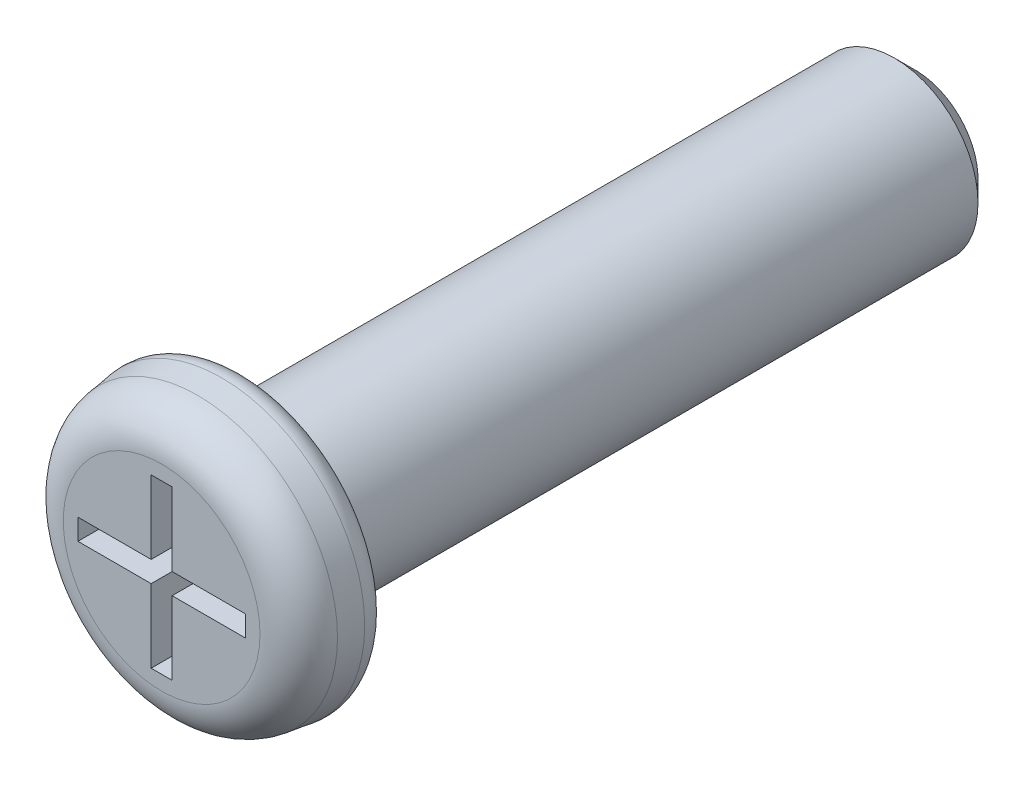
ISO-10303-21;
HEADER;
FILE_DESCRIPTION(('STEP AP214'),'2;1');
FILE_NAME('part.step','',(''),(''),'','','');
FILE_SCHEMA(('AUTOMOTIVE_DESIGN { 1 0 10303 214 1 1 1 1 }'));
ENDSEC;
DATA;
#1=APPLICATION_CONTEXT('core data for automotive mechanical design processes');
#2=APPLICATION_PROTOCOL_DEFINITION('international standard','automotive_design',2000,#1);
#3=PRODUCT_CONTEXT('',#1,'mechanical');
#4=PRODUCT('Part','Part','',(#3));
#5=PRODUCT_RELATED_PRODUCT_CATEGORY('part','',(#4));
#6=PRODUCT_DEFINITION_FORMATION('','',#4);
#7=PRODUCT_DEFINITION_CONTEXT('part definition',#1,'design');
#8=PRODUCT_DEFINITION('design','',#6,#7);
#9=PRODUCT_DEFINITION_SHAPE('','',#8);
#10=(LENGTH_UNIT() NAMED_UNIT(*) SI_UNIT(.MILLI.,.METRE.));
#11=(NAMED_UNIT(*) PLANE_ANGLE_UNIT() SI_UNIT($,.RADIAN.));
#12=(NAMED_UNIT(*) SI_UNIT($,.STERADIAN.) SOLID_ANGLE_UNIT());
#13=UNCERTAINTY_MEASURE_WITH_UNIT(LENGTH_MEASURE(1.E-05),#10,'distance_accuracy_value','');
#14=(GEOMETRIC_REPRESENTATION_CONTEXT(3) GLOBAL_UNCERTAINTY_ASSIGNED_CONTEXT((#13)) GLOBAL_UNIT_ASSIGNED_CONTEXT((#10,
#11,#12)) REPRESENTATION_CONTEXT('',''));
#15=CARTESIAN_POINT('',(0.,0.,0.));
#16=DIRECTION('',(0.,0.,1.));
#17=DIRECTION('',(1.,0.,0.));
#18=AXIS2_PLACEMENT_3D('',#15,#16,#17);
#19=CARTESIAN_POINT('',(0.,0.,0.));
#20=DIRECTION('',(0.,0.,1.));
#21=DIRECTION('',(1.,0.,0.));
#22=AXIS2_PLACEMENT_3D('',#19,#20,#21);
#23=PLANE('',#22);
#24=CARTESIAN_POINT('',(0.,0.,0.));
#25=DIRECTION('',(0.,0.,1.));
#26=DIRECTION('',(1.,0.,0.));
#27=AXIS2_PLACEMENT_3D('',#24,#25,#26);
#28=CIRCLE('',#27,1.46240789819475);
#29=CARTESIAN_POINT('',(1.46240789819475,0.,0.));
#30=VERTEX_POINT('',#29);
#31=EDGE_CURVE('E11',#30,#30,#28,.F.);
#32=ORIENTED_EDGE('',*,*,#31,.T.);
#33=EDGE_LOOP('',(#32));
#34=FACE_BOUND('',#33,.T.);
#35=CARTESIAN_POINT('',(0.,0.,0.));
#36=DIRECTION('',(0.,0.,1.));
#37=DIRECTION('',(1.,0.,0.));
#38=AXIS2_PLACEMENT_3D('',#35,#36,#37);
#39=CIRCLE('',#38,1.);
#40=CARTESIAN_POINT('',(1.,0.,0.));
#41=VERTEX_POINT('',#40);
#42=EDGE_CURVE('E230',#41,#41,#39,.F.);
#43=ORIENTED_EDGE('',*,*,#42,.F.);
#44=EDGE_LOOP('',(#43));
#45=FACE_BOUND('',#44,.T.);
#46=ADVANCED_FACE('F31',(#34,#45),#23,.F.);
#47=CARTESIAN_POINT('',(0.,0.,0.));
#48=DIRECTION('',(0.,0.,-1.));
#49=DIRECTION('',(1.,0.,0.));
#50=AXIS2_PLACEMENT_3D('',#47,#48,#49);
#51=CONICAL_SURFACE('',#50,1.75,0.139626340159547);
#52=CARTESIAN_POINT('',(0.,0.,0.284793275240017));
#53=DIRECTION('',(0.,0.,1.));
#54=DIRECTION('',(1.,0.,0.));
#55=AXIS2_PLACEMENT_3D('',#52,#53,#54);
#56=CIRCLE('',#55,1.70997491538014);
#57=CARTESIAN_POINT('',(1.70997491538014,0.,0.284793275240017));
#58=VERTEX_POINT('',#57);
#59=EDGE_CURVE('E39',#58,#58,#56,.T.);
#60=ORIENTED_EDGE('',*,*,#59,.T.);
#61=EDGE_LOOP('',(#60));
#62=FACE_BOUND('',#61,.T.);
#63=CARTESIAN_POINT('',(0.,0.,0.569586550480033));
#64=DIRECTION('',(0.,0.,-1.));
#65=DIRECTION('',(-1.,0.,0.));
#66=AXIS2_PLACEMENT_3D('',#63,#64,#65);
#67=CIRCLE('',#66,1.66994983076028);
#68=CARTESIAN_POINT('',(-1.66994983076028,0.,0.569586550480033));
#69=VERTEX_POINT('',#68);
#70=EDGE_CURVE('E227',#69,#69,#67,.T.);
#71=ORIENTED_EDGE('',*,*,#70,.T.);
#72=EDGE_LOOP('',(#71));
#73=FACE_BOUND('',#72,.T.);
#74=ADVANCED_FACE('F33',(#62,#73),#51,.T.);
#75=CARTESIAN_POINT('',(0.,0.,1.));
#76=DIRECTION('',(0.,0.,1.));
#77=DIRECTION('',(1.,0.,0.));
#78=AXIS2_PLACEMENT_3D('',#75,#76,#77);
#79=PLANE('',#78);
#80=DIRECTION('',(-1.,0.,0.));
#81=VECTOR('',#80,1.);
#82=CARTESIAN_POINT('',(0.125,1.,1.));
#83=LINE('',#82,#81);
#84=CARTESIAN_POINT('',(0.125,1.,1.));
#85=VERTEX_POINT('',#84);
#86=CARTESIAN_POINT('',(-0.125,1.,1.));
#87=VERTEX_POINT('',#86);
#88=EDGE_CURVE('E46',#85,#87,#83,.T.);
#89=ORIENTED_EDGE('',*,*,#88,.F.);
#90=DIRECTION('',(0.,1.,0.));
#91=VECTOR('',#90,1.);
#92=CARTESIAN_POINT('',(0.125,1.,1.));
#93=LINE('',#92,#91);
#94=CARTESIAN_POINT('',(0.125,0.124999999999999,1.));
#95=VERTEX_POINT('',#94);
#96=EDGE_CURVE('E170',#95,#85,#93,.T.);
#97=ORIENTED_EDGE('',*,*,#96,.F.);
#98=DIRECTION('',(-1.,0.,0.));
#99=VECTOR('',#98,1.);
#100=CARTESIAN_POINT('',(1.,0.124999999999996,1.));
#101=LINE('',#100,#99);
#102=CARTESIAN_POINT('',(1.,0.124999999999996,1.));
#103=VERTEX_POINT('',#102);
#104=EDGE_CURVE('E167',#103,#95,#101,.T.);
#105=ORIENTED_EDGE('',*,*,#104,.F.);
#106=DIRECTION('',(0.,1.,0.));
#107=VECTOR('',#106,1.);
#108=CARTESIAN_POINT('',(1.,-0.125000000000003,1.));
#109=LINE('',#108,#107);
#110=CARTESIAN_POINT('',(1.,-0.125000000000003,1.));
#111=VERTEX_POINT('',#110);
#112=EDGE_CURVE('E164',#111,#103,#109,.T.);
#113=ORIENTED_EDGE('',*,*,#112,.F.);
#114=DIRECTION('',(1.,0.,0.));
#115=VECTOR('',#114,1.);
#116=CARTESIAN_POINT('',(1.,-0.125000000000003,1.));
#117=LINE('',#116,#115);
#118=CARTESIAN_POINT('',(0.124999999999999,-0.125,1.));
#119=VERTEX_POINT('',#118);
#120=EDGE_CURVE('E161',#119,#111,#117,.T.);
#121=ORIENTED_EDGE('',*,*,#120,.F.);
#122=DIRECTION('',(0.,1.,0.));
#123=VECTOR('',#122,1.);
#124=CARTESIAN_POINT('',(0.124999999999993,-1.,1.));
#125=LINE('',#124,#123);
#126=CARTESIAN_POINT('',(0.124999999999993,-1.,1.));
#127=VERTEX_POINT('',#126);
#128=EDGE_CURVE('E158',#127,#119,#125,.T.);
#129=ORIENTED_EDGE('',*,*,#128,.F.);
#130=DIRECTION('',(1.,0.,0.));
#131=VECTOR('',#130,1.);
#132=CARTESIAN_POINT('',(-0.125000000000007,-0.999999999999999,1.));
#133=LINE('',#132,#131);
#134=CARTESIAN_POINT('',(-0.125000000000007,-0.999999999999999,1.));
#135=VERTEX_POINT('',#134);
#136=EDGE_CURVE('E155',#135,#127,#133,.T.);
#137=ORIENTED_EDGE('',*,*,#136,.F.);
#138=DIRECTION('',(0.,-1.,0.));
#139=VECTOR('',#138,1.);
#140=CARTESIAN_POINT('',(-0.125000000000007,-0.999999999999999,1.));
#141=LINE('',#140,#139);
#142=CARTESIAN_POINT('',(-0.125000000000001,-0.124999999999998,1.));
#143=VERTEX_POINT('',#142);
#144=EDGE_CURVE('E152',#143,#135,#141,.T.);
#145=ORIENTED_EDGE('',*,*,#144,.F.);
#146=DIRECTION('',(1.,0.,0.));
#147=VECTOR('',#146,1.);
#148=CARTESIAN_POINT('',(-1.,-0.124999999999989,1.));
#149=LINE('',#148,#147);
#150=CARTESIAN_POINT('',(-1.,-0.124999999999989,1.));
#151=VERTEX_POINT('',#150);
#152=EDGE_CURVE('E146',#151,#143,#149,.T.);
#153=ORIENTED_EDGE('',*,*,#152,.F.);
#154=DIRECTION('',(0.,-1.,0.));
#155=VECTOR('',#154,1.);
#156=CARTESIAN_POINT('',(-0.999999999999999,0.12500000000001,1.));
#157=LINE('',#156,#155);
#158=CARTESIAN_POINT('',(-0.999999999999999,0.12500000000001,1.));
#159=VERTEX_POINT('',#158);
#160=EDGE_CURVE('E144',#159,#151,#157,.T.);
#161=ORIENTED_EDGE('',*,*,#160,.F.);
#162=DIRECTION('',(-1.,0.,0.));
#163=VECTOR('',#162,1.);
#164=CARTESIAN_POINT('',(-0.999999999999999,0.12500000000001,1.));
#165=LINE('',#164,#163);
#166=CARTESIAN_POINT('',(-0.125,0.125000000000001,1.));
#167=VERTEX_POINT('',#166);
#168=EDGE_CURVE('E125',#167,#159,#165,.T.);
#169=ORIENTED_EDGE('',*,*,#168,.F.);
#170=DIRECTION('',(0.,-1.,0.));
#171=VECTOR('',#170,1.);
#172=CARTESIAN_POINT('',(-0.125,1.,1.));
#173=LINE('',#172,#171);
#174=EDGE_CURVE('E136',#87,#167,#173,.T.);
#175=ORIENTED_EDGE('',*,*,#174,.F.);
#176=EDGE_LOOP('',(#89,#97,#105,#113,#121,#129,#137,#145,#153,#161,#169,#175));
#177=FACE_BOUND('',#176,.T.);
#178=CARTESIAN_POINT('',(0.,0.,1.));
#179=DIRECTION('',(0.,0.,1.));
#180=DIRECTION('',(1.,0.,0.));
#181=AXIS2_PLACEMENT_3D('',#178,#179,#180);
#182=CIRCLE('',#181,1.1748157963895);
#183=CARTESIAN_POINT('',(1.1748157963895,0.,1.));
#184=VERTEX_POINT('',#183);
#185=EDGE_CURVE('E206',#184,#184,#182,.T.);
#186=ORIENTED_EDGE('',*,*,#185,.T.);
#187=EDGE_LOOP('',(#186));
#188=FACE_BOUND('',#187,.T.);
#189=ADVANCED_FACE('F140',(#177,#188),#79,.T.);
#190=CARTESIAN_POINT('',(0.,0.,0.5));
#191=DIRECTION('',(0.,0.,1.));
#192=DIRECTION('',(1.,0.,0.));
#193=AXIS2_PLACEMENT_3D('',#190,#191,#192);
#194=TOROIDAL_SURFACE('',#193,1.1748157963895,0.5);
#195=ORIENTED_EDGE('',*,*,#70,.F.);
#196=EDGE_LOOP('',(#195));
#197=FACE_BOUND('',#196,.T.);
#198=ORIENTED_EDGE('',*,*,#185,.F.);
#199=EDGE_LOOP('',(#198));
#200=FACE_BOUND('',#199,.T.);
#201=ADVANCED_FACE('F262',(#197,#200),#194,.T.);
#202=CARTESIAN_POINT('',(0.,0.,-8.));
#203=DIRECTION('',(0.,0.,1.));
#204=DIRECTION('',(1.,0.,0.));
#205=AXIS2_PLACEMENT_3D('',#202,#203,#204);
#206=CYLINDRICAL_SURFACE('',#205,1.);
#207=CARTESIAN_POINT('',(0.,0.,-7.75));
#208=DIRECTION('',(0.,0.,-1.));
#209=DIRECTION('',(-1.,0.,0.));
#210=AXIS2_PLACEMENT_3D('',#207,#208,#209);
#211=CIRCLE('',#210,1.);
#212=CARTESIAN_POINT('',(-1.,0.,-7.75));
#213=VERTEX_POINT('',#212);
#214=EDGE_CURVE('E236',#213,#213,#211,.F.);
#215=ORIENTED_EDGE('',*,*,#214,.T.);
#216=EDGE_LOOP('',(#215));
#217=FACE_BOUND('',#216,.T.);
#218=ORIENTED_EDGE('',*,*,#42,.T.);
#219=EDGE_LOOP('',(#218));
#220=FACE_BOUND('',#219,.T.);
#221=ADVANCED_FACE('F268',(#217,#220),#206,.T.);
#222=CARTESIAN_POINT('',(0.,0.,-8.));
#223=DIRECTION('',(0.,0.,-1.));
#224=DIRECTION('',(-1.,0.,0.));
#225=AXIS2_PLACEMENT_3D('',#222,#223,#224);
#226=PLANE('',#225);
#227=CARTESIAN_POINT('',(0.,0.,-8.));
#228=DIRECTION('',(0.,0.,-1.));
#229=DIRECTION('',(-1.,0.,0.));
#230=AXIS2_PLACEMENT_3D('',#227,#228,#229);
#231=CIRCLE('',#230,0.749999999999996);
#232=CARTESIAN_POINT('',(-0.749999999999996,0.,-8.));
#233=VERTEX_POINT('',#232);
#234=EDGE_CURVE('E233',#233,#233,#231,.T.);
#235=ORIENTED_EDGE('',*,*,#234,.T.);
#236=EDGE_LOOP('',(#235));
#237=FACE_BOUND('',#236,.T.);
#238=ADVANCED_FACE('F273',(#237),#226,.T.);
#239=CARTESIAN_POINT('',(0.,0.,-8.));
#240=DIRECTION('',(0.,0.,1.));
#241=DIRECTION('',(1.,0.,0.));
#242=AXIS2_PLACEMENT_3D('',#239,#240,#241);
#243=CONICAL_SURFACE('',#242,0.749999999999996,0.785398163397453);
#244=ORIENTED_EDGE('',*,*,#214,.F.);
#245=EDGE_LOOP('',(#244));
#246=FACE_BOUND('',#245,.T.);
#247=ORIENTED_EDGE('',*,*,#234,.F.);
#248=EDGE_LOOP('',(#247));
#249=FACE_BOUND('',#248,.T.);
#250=ADVANCED_FACE('F281',(#246,#249),#243,.T.);
#251=CARTESIAN_POINT('',(0.125,1.,0.5));
#252=DIRECTION('',(0.,1.,0.));
#253=DIRECTION('',(0.,0.,1.));
#254=AXIS2_PLACEMENT_3D('',#251,#252,#253);
#255=PLANE('',#254);
#256=ORIENTED_EDGE('',*,*,#88,.T.);
#257=DIRECTION('',(0.,0.,1.));
#258=VECTOR('',#257,1.);
#259=CARTESIAN_POINT('',(-0.125,1.,0.5));
#260=LINE('',#259,#258);
#261=CARTESIAN_POINT('',(-0.125,1.,0.5));
#262=VERTEX_POINT('',#261);
#263=EDGE_CURVE('E133',#262,#87,#260,.T.);
#264=ORIENTED_EDGE('',*,*,#263,.F.);
#265=DIRECTION('',(-1.,0.,0.));
#266=VECTOR('',#265,1.);
#267=CARTESIAN_POINT('',(0.125,1.,0.5));
#268=LINE('',#267,#266);
#269=CARTESIAN_POINT('',(0.125,1.,0.5));
#270=VERTEX_POINT('',#269);
#271=EDGE_CURVE('E172',#270,#262,#268,.T.);
#272=ORIENTED_EDGE('',*,*,#271,.F.);
#273=DIRECTION('',(0.,0.,1.));
#274=VECTOR('',#273,1.);
#275=CARTESIAN_POINT('',(0.125,1.,0.5));
#276=LINE('',#275,#274);
#277=EDGE_CURVE('E53',#270,#85,#276,.T.);
#278=ORIENTED_EDGE('',*,*,#277,.T.);
#279=EDGE_LOOP('',(#256,#264,#272,#278));
#280=FACE_BOUND('',#279,.T.);
#281=ADVANCED_FACE('F288',(#280),#255,.F.);
#282=CARTESIAN_POINT('',(0.125,1.,0.5));
#283=DIRECTION('',(1.,0.,0.));
#284=DIRECTION('',(0.,1.,0.));
#285=AXIS2_PLACEMENT_3D('',#282,#283,#284);
#286=PLANE('',#285);
#287=ORIENTED_EDGE('',*,*,#96,.T.);
#288=ORIENTED_EDGE('',*,*,#277,.F.);
#289=DIRECTION('',(0.,1.,0.));
#290=VECTOR('',#289,1.);
#291=CARTESIAN_POINT('',(0.125,1.,0.5));
#292=LINE('',#291,#290);
#293=CARTESIAN_POINT('',(0.125,0.124999999999999,0.5));
#294=VERTEX_POINT('',#293);
#295=EDGE_CURVE('E202',#294,#270,#292,.T.);
#296=ORIENTED_EDGE('',*,*,#295,.F.);
#297=DIRECTION('',(0.,0.,1.));
#298=VECTOR('',#297,1.);
#299=CARTESIAN_POINT('',(0.125,0.124999999999999,0.5));
#300=LINE('',#299,#298);
#301=EDGE_CURVE('E207',#294,#95,#300,.T.);
#302=ORIENTED_EDGE('',*,*,#301,.T.);
#303=EDGE_LOOP('',(#287,#288,#296,#302));
#304=FACE_BOUND('',#303,.T.);
#305=ADVANCED_FACE('F292',(#304),#286,.F.);
#306=CARTESIAN_POINT('',(1.,0.124999999999996,0.5));
#307=DIRECTION('',(0.,1.,0.));
#308=DIRECTION('',(-1.,0.,0.));
#309=AXIS2_PLACEMENT_3D('',#306,#307,#308);
#310=PLANE('',#309);
#311=ORIENTED_EDGE('',*,*,#104,.T.);
#312=ORIENTED_EDGE('',*,*,#301,.F.);
#313=DIRECTION('',(-1.,0.,0.));
#314=VECTOR('',#313,1.);
#315=CARTESIAN_POINT('',(1.,0.124999999999996,0.5));
#316=LINE('',#315,#314);
#317=CARTESIAN_POINT('',(1.,0.124999999999996,0.5));
#318=VERTEX_POINT('',#317);
#319=EDGE_CURVE('E199',#318,#294,#316,.T.);
#320=ORIENTED_EDGE('',*,*,#319,.F.);
#321=DIRECTION('',(0.,0.,1.));
#322=VECTOR('',#321,1.);
#323=CARTESIAN_POINT('',(1.,0.124999999999996,0.5));
#324=LINE('',#323,#322);
#325=EDGE_CURVE('E209',#318,#103,#324,.T.);
#326=ORIENTED_EDGE('',*,*,#325,.T.);
#327=EDGE_LOOP('',(#311,#312,#320,#326));
#328=FACE_BOUND('',#327,.T.);
#329=ADVANCED_FACE('F324',(#328),#310,.F.);
#330=CARTESIAN_POINT('',(1.,-0.125000000000003,0.5));
#331=DIRECTION('',(1.,0.,0.));
#332=DIRECTION('',(0.,1.,0.));
#333=AXIS2_PLACEMENT_3D('',#330,#331,#332);
#334=PLANE('',#333);
#335=ORIENTED_EDGE('',*,*,#112,.T.);
#336=ORIENTED_EDGE('',*,*,#325,.F.);
#337=DIRECTION('',(0.,1.,0.));
#338=VECTOR('',#337,1.);
#339=CARTESIAN_POINT('',(1.,-0.125000000000003,0.5));
#340=LINE('',#339,#338);
#341=CARTESIAN_POINT('',(1.,-0.125000000000003,0.5));
#342=VERTEX_POINT('',#341);
#343=EDGE_CURVE('E196',#342,#318,#340,.T.);
#344=ORIENTED_EDGE('',*,*,#343,.F.);
#345=DIRECTION('',(0.,0.,1.));
#346=VECTOR('',#345,1.);
#347=CARTESIAN_POINT('',(1.,-0.125000000000003,0.5));
#348=LINE('',#347,#346);
#349=EDGE_CURVE('E211',#342,#111,#348,.T.);
#350=ORIENTED_EDGE('',*,*,#349,.T.);
#351=EDGE_LOOP('',(#335,#336,#344,#350));
#352=FACE_BOUND('',#351,.T.);
#353=ADVANCED_FACE('F320',(#352),#334,.F.);
#354=CARTESIAN_POINT('',(1.,-0.125000000000003,0.5));
#355=DIRECTION('',(0.,-1.,0.));
#356=DIRECTION('',(1.,0.,0.));
#357=AXIS2_PLACEMENT_3D('',#354,#355,#356);
#358=PLANE('',#357);
#359=ORIENTED_EDGE('',*,*,#120,.T.);
#360=ORIENTED_EDGE('',*,*,#349,.F.);
#361=DIRECTION('',(1.,0.,0.));
#362=VECTOR('',#361,1.);
#363=CARTESIAN_POINT('',(1.,-0.125000000000003,0.5));
#364=LINE('',#363,#362);
#365=CARTESIAN_POINT('',(0.124999999999999,-0.125,0.5));
#366=VERTEX_POINT('',#365);
#367=EDGE_CURVE('E193',#366,#342,#364,.T.);
#368=ORIENTED_EDGE('',*,*,#367,.F.);
#369=DIRECTION('',(0.,0.,1.));
#370=VECTOR('',#369,1.);
#371=CARTESIAN_POINT('',(0.124999999999999,-0.125,0.5));
#372=LINE('',#371,#370);
#373=EDGE_CURVE('E213',#366,#119,#372,.T.);
#374=ORIENTED_EDGE('',*,*,#373,.T.);
#375=EDGE_LOOP('',(#359,#360,#368,#374));
#376=FACE_BOUND('',#375,.T.);
#377=ADVANCED_FACE('F316',(#376),#358,.F.);
#378=CARTESIAN_POINT('',(0.124999999999993,-1.,0.5));
#379=DIRECTION('',(1.,0.,0.));
#380=DIRECTION('',(0.,1.,0.));
#381=AXIS2_PLACEMENT_3D('',#378,#379,#380);
#382=PLANE('',#381);
#383=ORIENTED_EDGE('',*,*,#128,.T.);
#384=ORIENTED_EDGE('',*,*,#373,.F.);
#385=DIRECTION('',(0.,1.,0.));
#386=VECTOR('',#385,1.);
#387=CARTESIAN_POINT('',(0.124999999999993,-1.,0.5));
#388=LINE('',#387,#386);
#389=CARTESIAN_POINT('',(0.124999999999993,-1.,0.5));
#390=VERTEX_POINT('',#389);
#391=EDGE_CURVE('E190',#390,#366,#388,.T.);
#392=ORIENTED_EDGE('',*,*,#391,.F.);
#393=DIRECTION('',(0.,0.,1.));
#394=VECTOR('',#393,1.);
#395=CARTESIAN_POINT('',(0.124999999999993,-1.,0.5));
#396=LINE('',#395,#394);
#397=EDGE_CURVE('E215',#390,#127,#396,.T.);
#398=ORIENTED_EDGE('',*,*,#397,.T.);
#399=EDGE_LOOP('',(#383,#384,#392,#398));
#400=FACE_BOUND('',#399,.T.);
#401=ADVANCED_FACE('F312',(#400),#382,.F.);
#402=CARTESIAN_POINT('',(-0.125000000000007,-0.999999999999999,0.5));
#403=DIRECTION('',(0.,-1.,0.));
#404=DIRECTION('',(1.,0.,0.));
#405=AXIS2_PLACEMENT_3D('',#402,#403,#404);
#406=PLANE('',#405);
#407=ORIENTED_EDGE('',*,*,#136,.T.);
#408=ORIENTED_EDGE('',*,*,#397,.F.);
#409=DIRECTION('',(1.,0.,0.));
#410=VECTOR('',#409,1.);
#411=CARTESIAN_POINT('',(-0.125000000000007,-0.999999999999999,0.5));
#412=LINE('',#411,#410);
#413=CARTESIAN_POINT('',(-0.125000000000007,-0.999999999999999,0.5));
#414=VERTEX_POINT('',#413);
#415=EDGE_CURVE('E187',#414,#390,#412,.T.);
#416=ORIENTED_EDGE('',*,*,#415,.F.);
#417=DIRECTION('',(0.,0.,1.));
#418=VECTOR('',#417,1.);
#419=CARTESIAN_POINT('',(-0.125000000000007,-0.999999999999999,0.5));
#420=LINE('',#419,#418);
#421=EDGE_CURVE('E217',#414,#135,#420,.T.);
#422=ORIENTED_EDGE('',*,*,#421,.T.);
#423=EDGE_LOOP('',(#407,#408,#416,#422));
#424=FACE_BOUND('',#423,.T.);
#425=ADVANCED_FACE('F308',(#424),#406,.F.);
#426=CARTESIAN_POINT('',(-0.125000000000007,-0.999999999999999,0.5));
#427=DIRECTION('',(-1.,0.,0.));
#428=DIRECTION('',(0.,-1.,0.));
#429=AXIS2_PLACEMENT_3D('',#426,#427,#428);
#430=PLANE('',#429);
#431=ORIENTED_EDGE('',*,*,#144,.T.);
#432=ORIENTED_EDGE('',*,*,#421,.F.);
#433=DIRECTION('',(0.,-1.,0.));
#434=VECTOR('',#433,1.);
#435=CARTESIAN_POINT('',(-0.125000000000007,-0.999999999999999,0.5));
#436=LINE('',#435,#434);
#437=CARTESIAN_POINT('',(-0.125000000000001,-0.124999999999998,0.5));
#438=VERTEX_POINT('',#437);
#439=EDGE_CURVE('E184',#438,#414,#436,.T.);
#440=ORIENTED_EDGE('',*,*,#439,.F.);
#441=DIRECTION('',(0.,0.,1.));
#442=VECTOR('',#441,1.);
#443=CARTESIAN_POINT('',(-0.125000000000001,-0.124999999999998,0.5));
#444=LINE('',#443,#442);
#445=EDGE_CURVE('E219',#438,#143,#444,.T.);
#446=ORIENTED_EDGE('',*,*,#445,.T.);
#447=EDGE_LOOP('',(#431,#432,#440,#446));
#448=FACE_BOUND('',#447,.T.);
#449=ADVANCED_FACE('F304',(#448),#430,.F.);
#450=CARTESIAN_POINT('',(-1.,-0.124999999999989,0.5));
#451=DIRECTION('',(0.,-1.,0.));
#452=DIRECTION('',(1.,0.,0.));
#453=AXIS2_PLACEMENT_3D('',#450,#451,#452);
#454=PLANE('',#453);
#455=ORIENTED_EDGE('',*,*,#152,.T.);
#456=ORIENTED_EDGE('',*,*,#445,.F.);
#457=DIRECTION('',(1.,0.,0.));
#458=VECTOR('',#457,1.);
#459=CARTESIAN_POINT('',(-1.,-0.124999999999989,0.5));
#460=LINE('',#459,#458);
#461=CARTESIAN_POINT('',(-1.,-0.124999999999989,0.5));
#462=VERTEX_POINT('',#461);
#463=EDGE_CURVE('E181',#462,#438,#460,.T.);
#464=ORIENTED_EDGE('',*,*,#463,.F.);
#465=DIRECTION('',(0.,0.,1.));
#466=VECTOR('',#465,1.);
#467=CARTESIAN_POINT('',(-1.,-0.124999999999989,0.5));
#468=LINE('',#467,#466);
#469=EDGE_CURVE('E221',#462,#151,#468,.T.);
#470=ORIENTED_EDGE('',*,*,#469,.T.);
#471=EDGE_LOOP('',(#455,#456,#464,#470));
#472=FACE_BOUND('',#471,.T.);
#473=ADVANCED_FACE('F300',(#472),#454,.F.);
#474=CARTESIAN_POINT('',(-0.999999999999999,0.12500000000001,0.5));
#475=DIRECTION('',(-1.,0.,0.));
#476=DIRECTION('',(0.,-1.,0.));
#477=AXIS2_PLACEMENT_3D('',#474,#475,#476);
#478=PLANE('',#477);
#479=ORIENTED_EDGE('',*,*,#160,.T.);
#480=ORIENTED_EDGE('',*,*,#469,.F.);
#481=DIRECTION('',(0.,-1.,0.));
#482=VECTOR('',#481,1.);
#483=CARTESIAN_POINT('',(-0.999999999999999,0.12500000000001,0.5));
#484=LINE('',#483,#482);
#485=CARTESIAN_POINT('',(-0.999999999999999,0.12500000000001,0.5));
#486=VERTEX_POINT('',#485);
#487=EDGE_CURVE('E178',#486,#462,#484,.T.);
#488=ORIENTED_EDGE('',*,*,#487,.F.);
#489=DIRECTION('',(0.,0.,1.));
#490=VECTOR('',#489,1.);
#491=CARTESIAN_POINT('',(-0.999999999999999,0.12500000000001,0.5));
#492=LINE('',#491,#490);
#493=EDGE_CURVE('E132',#486,#159,#492,.T.);
#494=ORIENTED_EDGE('',*,*,#493,.T.);
#495=EDGE_LOOP('',(#479,#480,#488,#494));
#496=FACE_BOUND('',#495,.T.);
#497=ADVANCED_FACE('F297',(#496),#478,.F.);
#498=CARTESIAN_POINT('',(-0.999999999999999,0.12500000000001,0.5));
#499=DIRECTION('',(0.,1.,0.));
#500=DIRECTION('',(-1.,0.,0.));
#501=AXIS2_PLACEMENT_3D('',#498,#499,#500);
#502=PLANE('',#501);
#503=ORIENTED_EDGE('',*,*,#168,.T.);
#504=ORIENTED_EDGE('',*,*,#493,.F.);
#505=DIRECTION('',(-1.,0.,0.));
#506=VECTOR('',#505,1.);
#507=CARTESIAN_POINT('',(-0.999999999999999,0.12500000000001,0.5));
#508=LINE('',#507,#506);
#509=CARTESIAN_POINT('',(-0.125,0.125000000000001,0.5));
#510=VERTEX_POINT('',#509);
#511=EDGE_CURVE('E128',#510,#486,#508,.T.);
#512=ORIENTED_EDGE('',*,*,#511,.F.);
#513=DIRECTION('',(0.,0.,1.));
#514=VECTOR('',#513,1.);
#515=CARTESIAN_POINT('',(-0.125,0.125000000000001,0.5));
#516=LINE('',#515,#514);
#517=EDGE_CURVE('E121',#510,#167,#516,.T.);
#518=ORIENTED_EDGE('',*,*,#517,.T.);
#519=EDGE_LOOP('',(#503,#504,#512,#518));
#520=FACE_BOUND('',#519,.T.);
#521=ADVANCED_FACE('F123',(#520),#502,.F.);
#522=CARTESIAN_POINT('',(-0.125,1.,0.5));
#523=DIRECTION('',(-1.,0.,0.));
#524=DIRECTION('',(0.,-1.,0.));
#525=AXIS2_PLACEMENT_3D('',#522,#523,#524);
#526=PLANE('',#525);
#527=ORIENTED_EDGE('',*,*,#174,.T.);
#528=ORIENTED_EDGE('',*,*,#517,.F.);
#529=DIRECTION('',(0.,-1.,0.));
#530=VECTOR('',#529,1.);
#531=CARTESIAN_POINT('',(-0.125,1.,0.5));
#532=LINE('',#531,#530);
#533=EDGE_CURVE('E175',#262,#510,#532,.T.);
#534=ORIENTED_EDGE('',*,*,#533,.F.);
#535=ORIENTED_EDGE('',*,*,#263,.T.);
#536=EDGE_LOOP('',(#527,#528,#534,#535));
#537=FACE_BOUND('',#536,.T.);
#538=ADVANCED_FACE('F137',(#537),#526,.F.);
#539=CARTESIAN_POINT('',(0.125,1.,0.5));
#540=DIRECTION('',(0.,0.,1.));
#541=DIRECTION('',(1.,0.,0.));
#542=AXIS2_PLACEMENT_3D('',#539,#540,#541);
#543=PLANE('',#542);
#544=ORIENTED_EDGE('',*,*,#271,.T.);
#545=ORIENTED_EDGE('',*,*,#533,.T.);
#546=ORIENTED_EDGE('',*,*,#511,.T.);
#547=ORIENTED_EDGE('',*,*,#487,.T.);
#548=ORIENTED_EDGE('',*,*,#463,.T.);
#549=ORIENTED_EDGE('',*,*,#439,.T.);
#550=ORIENTED_EDGE('',*,*,#415,.T.);
#551=ORIENTED_EDGE('',*,*,#391,.T.);
#552=ORIENTED_EDGE('',*,*,#367,.T.);
#553=ORIENTED_EDGE('',*,*,#343,.T.);
#554=ORIENTED_EDGE('',*,*,#319,.T.);
#555=ORIENTED_EDGE('',*,*,#295,.T.);
#556=EDGE_LOOP('',(#544,#545,#546,#547,#548,#549,#550,#551,#552,#553,#554,#555));
#557=FACE_BOUND('',#556,.T.);
#558=ADVANCED_FACE('F245',(#557),#543,.T.);
#559=CARTESIAN_POINT('',(0.,0.,0.25));
#560=DIRECTION('',(0.,0.,1.));
#561=DIRECTION('',(1.,0.,0.));
#562=AXIS2_PLACEMENT_3D('',#559,#560,#561);
#563=TOROIDAL_SURFACE('',#562,1.46240789819475,0.25);
#564=ORIENTED_EDGE('',*,*,#31,.F.);
#565=EDGE_LOOP('',(#564));
#566=FACE_BOUND('',#565,.T.);
#567=ORIENTED_EDGE('',*,*,#59,.F.);
#568=EDGE_LOOP('',(#567));
#569=FACE_BOUND('',#568,.T.);
#570=ADVANCED_FACE('F243',(#566,#569),#563,.T.);
#571=CLOSED_SHELL('',(#46,#74,#189,#201,#221,#238,#250,#281,#305,#329,#353,#377,#401,#425,#449,
#473,#497,#521,#538,#558,#570));
#572=MANIFOLD_SOLID_BREP('B2',#571);
#573=ADVANCED_BREP_SHAPE_REPRESENTATION('',(#18,#572),#14);
#574=SHAPE_DEFINITION_REPRESENTATION(#9,#573);
ENDSEC;
END-ISO-10303-21;
